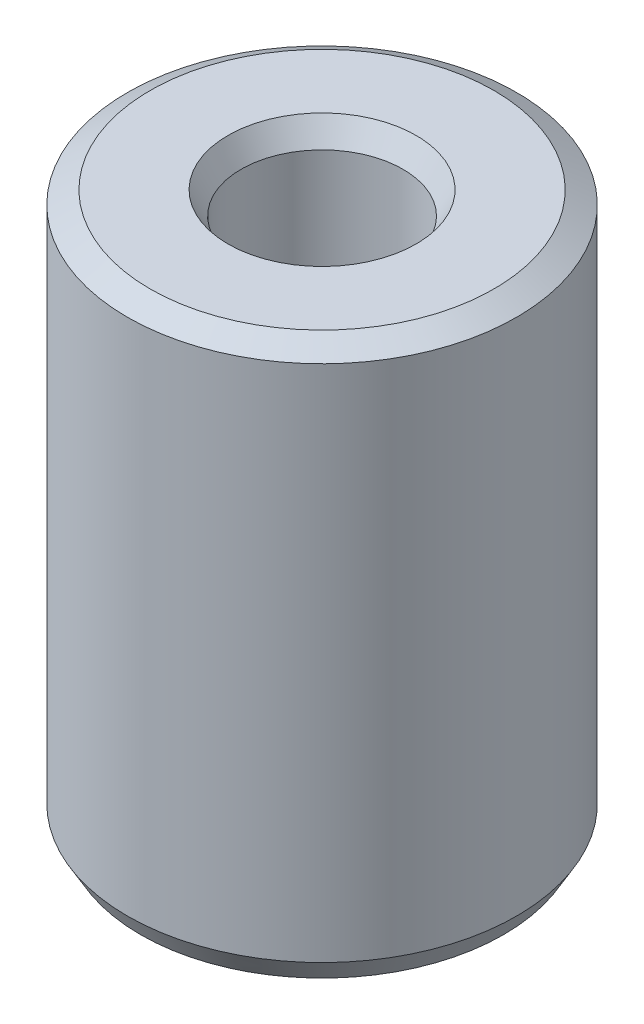
ISO-10303-21;
HEADER;
FILE_DESCRIPTION(('STEP AP214'),'2;1');
FILE_NAME('part.step','',(''),(''),'','','');
FILE_SCHEMA(('AUTOMOTIVE_DESIGN { 1 0 10303 214 1 1 1 1 }'));
ENDSEC;
DATA;
#1=APPLICATION_CONTEXT('core data for automotive mechanical design processes');
#2=APPLICATION_PROTOCOL_DEFINITION('international standard','automotive_design',2000,#1);
#3=PRODUCT_CONTEXT('',#1,'mechanical');
#4=PRODUCT('Part','Part','',(#3));
#5=PRODUCT_RELATED_PRODUCT_CATEGORY('part','',(#4));
#6=PRODUCT_DEFINITION_FORMATION('','',#4);
#7=PRODUCT_DEFINITION_CONTEXT('part definition',#1,'design');
#8=PRODUCT_DEFINITION('design','',#6,#7);
#9=PRODUCT_DEFINITION_SHAPE('','',#8);
#10=(LENGTH_UNIT() NAMED_UNIT(*) SI_UNIT(.MILLI.,.METRE.));
#11=(NAMED_UNIT(*) PLANE_ANGLE_UNIT() SI_UNIT($,.RADIAN.));
#12=(NAMED_UNIT(*) SI_UNIT($,.STERADIAN.) SOLID_ANGLE_UNIT());
#13=UNCERTAINTY_MEASURE_WITH_UNIT(LENGTH_MEASURE(1.E-05),#10,'distance_accuracy_value','');
#14=(GEOMETRIC_REPRESENTATION_CONTEXT(3) GLOBAL_UNCERTAINTY_ASSIGNED_CONTEXT((#13)) GLOBAL_UNIT_ASSIGNED_CONTEXT((#10,
#11,#12)) REPRESENTATION_CONTEXT('',''));
#15=CARTESIAN_POINT('',(0.,0.,0.));
#16=DIRECTION('',(0.,0.,1.));
#17=DIRECTION('',(1.,0.,0.));
#18=AXIS2_PLACEMENT_3D('',#15,#16,#17);
#19=CARTESIAN_POINT('',(0.,135.294523355562,0.));
#20=DIRECTION('',(0.,-1.,0.));
#21=DIRECTION('',(0.,0.,-1.));
#22=AXIS2_PLACEMENT_3D('',#19,#20,#21);
#23=CYLINDRICAL_SURFACE('',#22,47.5);
#24=CARTESIAN_POINT('',(0.,5.54424102309284,0.));
#25=DIRECTION('',(0.,1.,0.));
#26=DIRECTION('',(0.,0.,1.));
#27=AXIS2_PLACEMENT_3D('',#24,#25,#26);
#28=CIRCLE('',#27,47.5);
#29=CARTESIAN_POINT('',(0.,5.54424102309284,47.5));
#30=VERTEX_POINT('',#29);
#31=EDGE_CURVE('E10',#30,#30,#28,.T.);
#32=ORIENTED_EDGE('',*,*,#31,.T.);
#33=EDGE_LOOP('',(#32));
#34=FACE_BOUND('',#33,.T.);
#35=CARTESIAN_POINT('',(0.,132.093554308427,0.));
#36=DIRECTION('',(0.,1.,0.));
#37=DIRECTION('',(0.,0.,1.));
#38=AXIS2_PLACEMENT_3D('',#35,#36,#37);
#39=CIRCLE('',#38,47.5);
#40=CARTESIAN_POINT('',(0.,132.093554308427,47.5));
#41=VERTEX_POINT('',#40);
#42=EDGE_CURVE('E50',#41,#41,#39,.F.);
#43=ORIENTED_EDGE('',*,*,#42,.T.);
#44=EDGE_LOOP('',(#43));
#45=FACE_BOUND('',#44,.T.);
#46=ADVANCED_FACE('F39',(#34,#45),#23,.T.);
#47=CARTESIAN_POINT('',(0.,135.294523355562,0.));
#48=DIRECTION('',(0.,1.,0.));
#49=DIRECTION('',(0.,0.,1.));
#50=AXIS2_PLACEMENT_3D('',#47,#48,#49);
#51=PLANE('',#50);
#52=CARTESIAN_POINT('',(0.,135.294523355562,0.));
#53=DIRECTION('',(0.,1.,0.));
#54=DIRECTION('',(0.,0.,1.));
#55=AXIS2_PLACEMENT_3D('',#52,#53,#54);
#56=CIRCLE('',#55,22.9562841201936);
#57=CARTESIAN_POINT('',(0.,135.294523355562,22.9562841201936));
#58=VERTEX_POINT('',#57);
#59=EDGE_CURVE('E58',#58,#58,#56,.F.);
#60=ORIENTED_EDGE('',*,*,#59,.T.);
#61=EDGE_LOOP('',(#60));
#62=FACE_BOUND('',#61,.T.);
#63=CARTESIAN_POINT('',(0.,135.294523355562,0.));
#64=DIRECTION('',(0.,1.,0.));
#65=DIRECTION('',(0.,0.,1.));
#66=AXIS2_PLACEMENT_3D('',#63,#64,#65);
#67=CIRCLE('',#66,41.9557589769071);
#68=CARTESIAN_POINT('',(0.,135.294523355562,41.9557589769071));
#69=VERTEX_POINT('',#68);
#70=EDGE_CURVE('E61',#69,#69,#67,.T.);
#71=ORIENTED_EDGE('',*,*,#70,.T.);
#72=EDGE_LOOP('',(#71));
#73=FACE_BOUND('',#72,.T.);
#74=ADVANCED_FACE('F88',(#62,#73),#51,.T.);
#75=CARTESIAN_POINT('',(0.,0.,0.));
#76=DIRECTION('',(0.,1.,0.));
#77=DIRECTION('',(0.,0.,1.));
#78=AXIS2_PLACEMENT_3D('',#75,#76,#77);
#79=PLANE('',#78);
#80=CARTESIAN_POINT('',(0.,0.,0.));
#81=DIRECTION('',(0.,1.,0.));
#82=DIRECTION('',(0.,0.,1.));
#83=AXIS2_PLACEMENT_3D('',#80,#81,#82);
#84=CIRCLE('',#83,25.2995560961516);
#85=CARTESIAN_POINT('',(0.,0.,25.2995560961516));
#86=VERTEX_POINT('',#85);
#87=EDGE_CURVE('E51',#86,#86,#84,.T.);
#88=ORIENTED_EDGE('',*,*,#87,.T.);
#89=EDGE_LOOP('',(#88));
#90=FACE_BOUND('',#89,.T.);
#91=CARTESIAN_POINT('',(0.,0.,0.));
#92=DIRECTION('',(0.,1.,0.));
#93=DIRECTION('',(0.,0.,1.));
#94=AXIS2_PLACEMENT_3D('',#91,#92,#93);
#95=CIRCLE('',#94,44.2990309528652);
#96=CARTESIAN_POINT('',(0.,0.,44.2990309528652));
#97=VERTEX_POINT('',#96);
#98=EDGE_CURVE('E54',#97,#97,#95,.F.);
#99=ORIENTED_EDGE('',*,*,#98,.T.);
#100=EDGE_LOOP('',(#99));
#101=FACE_BOUND('',#100,.T.);
#102=ADVANCED_FACE('F83',(#90,#101),#79,.F.);
#103=CARTESIAN_POINT('',(0.,135.294523355562,0.));
#104=DIRECTION('',(0.,-1.,0.));
#105=DIRECTION('',(0.,0.,-1.));
#106=AXIS2_PLACEMENT_3D('',#103,#104,#105);
#107=CYLINDRICAL_SURFACE('',#106,19.7553150730588);
#108=CARTESIAN_POINT('',(0.,129.750282332469,0.));
#109=DIRECTION('',(0.,1.,0.));
#110=DIRECTION('',(0.,0.,1.));
#111=AXIS2_PLACEMENT_3D('',#108,#109,#110);
#112=CIRCLE('',#111,19.7553150730588);
#113=CARTESIAN_POINT('',(0.,129.750282332469,19.7553150730588));
#114=VERTEX_POINT('',#113);
#115=EDGE_CURVE('E67',#114,#114,#112,.T.);
#116=ORIENTED_EDGE('',*,*,#115,.T.);
#117=EDGE_LOOP('',(#116));
#118=FACE_BOUND('',#117,.T.);
#119=CARTESIAN_POINT('',(0.,3.20096904713488,0.));
#120=DIRECTION('',(0.,1.,0.));
#121=DIRECTION('',(0.,0.,1.));
#122=AXIS2_PLACEMENT_3D('',#119,#120,#121);
#123=CIRCLE('',#122,19.7553150730588);
#124=CARTESIAN_POINT('',(0.,3.20096904713488,19.7553150730588));
#125=VERTEX_POINT('',#124);
#126=EDGE_CURVE('E69',#125,#125,#123,.F.);
#127=ORIENTED_EDGE('',*,*,#126,.T.);
#128=EDGE_LOOP('',(#127));
#129=FACE_BOUND('',#128,.T.);
#130=ADVANCED_FACE('F71',(#118,#129),#107,.F.);
#131=CARTESIAN_POINT('',(0.,129.750282332469,0.));
#132=DIRECTION('',(0.,1.,0.));
#133=DIRECTION('',(0.,0.,1.));
#134=AXIS2_PLACEMENT_3D('',#131,#132,#133);
#135=CONICAL_SURFACE('',#134,19.7553150730588,0.5235987755983);
#136=ORIENTED_EDGE('',*,*,#59,.F.);
#137=EDGE_LOOP('',(#136));
#138=FACE_BOUND('',#137,.T.);
#139=ORIENTED_EDGE('',*,*,#115,.F.);
#140=EDGE_LOOP('',(#139));
#141=FACE_BOUND('',#140,.T.);
#142=ADVANCED_FACE('F77',(#138,#141),#135,.F.);
#143=CARTESIAN_POINT('',(0.,0.,0.));
#144=DIRECTION('',(0.,-1.,0.));
#145=DIRECTION('',(0.,0.,-1.));
#146=AXIS2_PLACEMENT_3D('',#143,#144,#145);
#147=CONICAL_SURFACE('',#146,25.2995560961516,1.04719755119659);
#148=ORIENTED_EDGE('',*,*,#126,.F.);
#149=EDGE_LOOP('',(#148));
#150=FACE_BOUND('',#149,.T.);
#151=ORIENTED_EDGE('',*,*,#87,.F.);
#152=EDGE_LOOP('',(#151));
#153=FACE_BOUND('',#152,.T.);
#154=ADVANCED_FACE('F73',(#150,#153),#147,.F.);
#155=CARTESIAN_POINT('',(0.,5.54424102309284,0.));
#156=DIRECTION('',(0.,1.,0.));
#157=DIRECTION('',(0.,0.,1.));
#158=AXIS2_PLACEMENT_3D('',#155,#156,#157);
#159=CONICAL_SURFACE('',#158,47.5,0.523598775598301);
#160=ORIENTED_EDGE('',*,*,#98,.F.);
#161=EDGE_LOOP('',(#160));
#162=FACE_BOUND('',#161,.T.);
#163=ORIENTED_EDGE('',*,*,#31,.F.);
#164=EDGE_LOOP('',(#163));
#165=FACE_BOUND('',#164,.T.);
#166=ADVANCED_FACE('F76',(#162,#165),#159,.T.);
#167=CARTESIAN_POINT('',(0.,135.294523355562,0.));
#168=DIRECTION('',(0.,-1.,0.));
#169=DIRECTION('',(0.,0.,-1.));
#170=AXIS2_PLACEMENT_3D('',#167,#168,#169);
#171=CONICAL_SURFACE('',#170,41.9557589769071,1.04719755119659);
#172=ORIENTED_EDGE('',*,*,#42,.F.);
#173=EDGE_LOOP('',(#172));
#174=FACE_BOUND('',#173,.T.);
#175=ORIENTED_EDGE('',*,*,#70,.F.);
#176=EDGE_LOOP('',(#175));
#177=FACE_BOUND('',#176,.T.);
#178=ADVANCED_FACE('F45',(#174,#177),#171,.T.);
#179=CLOSED_SHELL('',(#46,#74,#102,#130,#142,#154,#166,#178));
#180=MANIFOLD_SOLID_BREP('B2',#179);
#181=ADVANCED_BREP_SHAPE_REPRESENTATION('',(#18,#180),#14);
#182=SHAPE_DEFINITION_REPRESENTATION(#9,#181);
ENDSEC;
END-ISO-10303-21;
